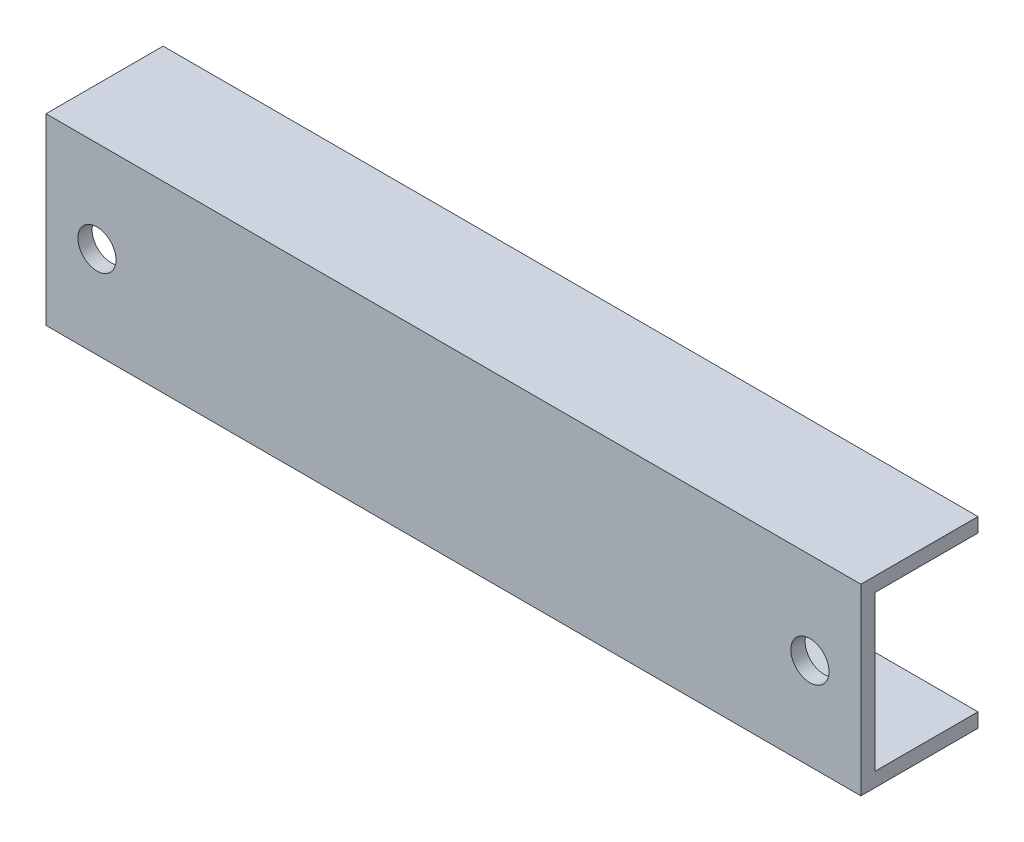
ISO-10303-21;
HEADER;
FILE_DESCRIPTION(('STEP AP214'),'2;1');
FILE_NAME('part.step','',(''),(''),'','','');
FILE_SCHEMA(('AUTOMOTIVE_DESIGN { 1 0 10303 214 1 1 1 1 }'));
ENDSEC;
DATA;
#1=APPLICATION_CONTEXT('core data for automotive mechanical design processes');
#2=APPLICATION_PROTOCOL_DEFINITION('international standard','automotive_design',2000,#1);
#3=PRODUCT_CONTEXT('',#1,'mechanical');
#4=PRODUCT('Part','Part','',(#3));
#5=PRODUCT_RELATED_PRODUCT_CATEGORY('part','',(#4));
#6=PRODUCT_DEFINITION_FORMATION('','',#4);
#7=PRODUCT_DEFINITION_CONTEXT('part definition',#1,'design');
#8=PRODUCT_DEFINITION('design','',#6,#7);
#9=PRODUCT_DEFINITION_SHAPE('','',#8);
#10=(LENGTH_UNIT() NAMED_UNIT(*) SI_UNIT(.MILLI.,.METRE.));
#11=(NAMED_UNIT(*) PLANE_ANGLE_UNIT() SI_UNIT($,.RADIAN.));
#12=(NAMED_UNIT(*) SI_UNIT($,.STERADIAN.) SOLID_ANGLE_UNIT());
#13=UNCERTAINTY_MEASURE_WITH_UNIT(LENGTH_MEASURE(1.E-05),#10,'distance_accuracy_value','');
#14=(GEOMETRIC_REPRESENTATION_CONTEXT(3) GLOBAL_UNCERTAINTY_ASSIGNED_CONTEXT((#13)) GLOBAL_UNIT_ASSIGNED_CONTEXT((#10,
#11,#12)) REPRESENTATION_CONTEXT('',''));
#15=CARTESIAN_POINT('',(0.,0.,0.));
#16=DIRECTION('',(0.,0.,1.));
#17=DIRECTION('',(1.,0.,0.));
#18=AXIS2_PLACEMENT_3D('',#15,#16,#17);
#19=CARTESIAN_POINT('',(50.8,11.43,-14.605));
#20=DIRECTION('',(0.,-1.,0.));
#21=DIRECTION('',(0.,0.,-1.));
#22=AXIS2_PLACEMENT_3D('',#19,#20,#21);
#23=PLANE('',#22);
#24=DIRECTION('',(0.,0.,1.));
#25=VECTOR('',#24,1.);
#26=CARTESIAN_POINT('',(-50.8,11.43,-14.605));
#27=LINE('',#26,#25);
#28=CARTESIAN_POINT('',(-50.8,11.43,-14.605));
#29=VERTEX_POINT('',#28);
#30=CARTESIAN_POINT('',(-50.8,11.43,0.));
#31=VERTEX_POINT('',#30);
#32=EDGE_CURVE('E137',#29,#31,#27,.T.);
#33=ORIENTED_EDGE('',*,*,#32,.T.);
#34=DIRECTION('',(-1.,0.,0.));
#35=VECTOR('',#34,1.);
#36=CARTESIAN_POINT('',(50.8,11.43,0.));
#37=LINE('',#36,#35);
#38=CARTESIAN_POINT('',(50.8,11.43,0.));
#39=VERTEX_POINT('',#38);
#40=EDGE_CURVE('E11',#39,#31,#37,.T.);
#41=ORIENTED_EDGE('',*,*,#40,.F.);
#42=DIRECTION('',(0.,0.,1.));
#43=VECTOR('',#42,1.);
#44=CARTESIAN_POINT('',(50.8,11.43,-14.605));
#45=LINE('',#44,#43);
#46=CARTESIAN_POINT('',(50.8,11.43,-14.605));
#47=VERTEX_POINT('',#46);
#48=EDGE_CURVE('E152',#47,#39,#45,.T.);
#49=ORIENTED_EDGE('',*,*,#48,.F.);
#50=DIRECTION('',(-1.,0.,0.));
#51=VECTOR('',#50,1.);
#52=CARTESIAN_POINT('',(50.8,11.43,-14.605));
#53=LINE('',#52,#51);
#54=EDGE_CURVE('E133',#47,#29,#53,.T.);
#55=ORIENTED_EDGE('',*,*,#54,.T.);
#56=EDGE_LOOP('',(#33,#41,#49,#55));
#57=FACE_BOUND('',#56,.T.);
#58=ADVANCED_FACE('F39',(#57),#23,.F.);
#59=CARTESIAN_POINT('',(50.8,11.43,0.));
#60=DIRECTION('',(0.,0.,-1.));
#61=DIRECTION('',(-1.,0.,0.));
#62=AXIS2_PLACEMENT_3D('',#59,#60,#61);
#63=PLANE('',#62);
#64=CARTESIAN_POINT('',(-44.45,0.,0.));
#65=DIRECTION('',(0.,0.,-1.));
#66=DIRECTION('',(-1.,0.,0.));
#67=AXIS2_PLACEMENT_3D('',#64,#65,#66);
#68=CIRCLE('',#67,2.38125);
#69=CARTESIAN_POINT('',(-46.83125,0.,0.));
#70=VERTEX_POINT('',#69);
#71=EDGE_CURVE('E172',#70,#70,#68,.T.);
#72=ORIENTED_EDGE('',*,*,#71,.T.);
#73=EDGE_LOOP('',(#72));
#74=FACE_BOUND('',#73,.T.);
#75=CARTESIAN_POINT('',(44.45,0.,0.));
#76=DIRECTION('',(0.,0.,1.));
#77=DIRECTION('',(1.,0.,0.));
#78=AXIS2_PLACEMENT_3D('',#75,#76,#77);
#79=CIRCLE('',#78,2.38125);
#80=CARTESIAN_POINT('',(46.83125,0.,0.));
#81=VERTEX_POINT('',#80);
#82=EDGE_CURVE('E164',#81,#81,#79,.T.);
#83=ORIENTED_EDGE('',*,*,#82,.F.);
#84=EDGE_LOOP('',(#83));
#85=FACE_BOUND('',#84,.T.);
#86=DIRECTION('',(0.,-1.,0.));
#87=VECTOR('',#86,1.);
#88=CARTESIAN_POINT('',(-50.8,11.43,0.));
#89=LINE('',#88,#87);
#90=CARTESIAN_POINT('',(-50.8,-11.43,0.));
#91=VERTEX_POINT('',#90);
#92=EDGE_CURVE('E140',#31,#91,#89,.T.);
#93=ORIENTED_EDGE('',*,*,#92,.T.);
#94=DIRECTION('',(-1.,0.,0.));
#95=VECTOR('',#94,1.);
#96=CARTESIAN_POINT('',(50.8,-11.43,0.));
#97=LINE('',#96,#95);
#98=CARTESIAN_POINT('',(50.8,-11.43,0.));
#99=VERTEX_POINT('',#98);
#100=EDGE_CURVE('E48',#99,#91,#97,.T.);
#101=ORIENTED_EDGE('',*,*,#100,.F.);
#102=DIRECTION('',(0.,-1.,0.));
#103=VECTOR('',#102,1.);
#104=CARTESIAN_POINT('',(50.8,11.43,0.));
#105=LINE('',#104,#103);
#106=EDGE_CURVE('E100',#39,#99,#105,.T.);
#107=ORIENTED_EDGE('',*,*,#106,.F.);
#108=ORIENTED_EDGE('',*,*,#40,.T.);
#109=EDGE_LOOP('',(#93,#101,#107,#108));
#110=FACE_BOUND('',#109,.T.);
#111=ADVANCED_FACE('F208',(#74,#85,#110),#63,.F.);
#112=CARTESIAN_POINT('',(50.8,-11.43,0.));
#113=DIRECTION('',(0.,1.,0.));
#114=DIRECTION('',(0.,0.,1.));
#115=AXIS2_PLACEMENT_3D('',#112,#113,#114);
#116=PLANE('',#115);
#117=DIRECTION('',(0.,0.,-1.));
#118=VECTOR('',#117,1.);
#119=CARTESIAN_POINT('',(-50.8,-11.43,0.));
#120=LINE('',#119,#118);
#121=CARTESIAN_POINT('',(-50.8,-11.43,-14.605));
#122=VERTEX_POINT('',#121);
#123=EDGE_CURVE('E143',#91,#122,#120,.T.);
#124=ORIENTED_EDGE('',*,*,#123,.T.);
#125=DIRECTION('',(-1.,0.,0.));
#126=VECTOR('',#125,1.);
#127=CARTESIAN_POINT('',(50.8,-11.43,-14.605));
#128=LINE('',#127,#126);
#129=CARTESIAN_POINT('',(50.8,-11.43,-14.605));
#130=VERTEX_POINT('',#129);
#131=EDGE_CURVE('E159',#130,#122,#128,.T.);
#132=ORIENTED_EDGE('',*,*,#131,.F.);
#133=DIRECTION('',(0.,0.,-1.));
#134=VECTOR('',#133,1.);
#135=CARTESIAN_POINT('',(50.8,-11.43,0.));
#136=LINE('',#135,#134);
#137=EDGE_CURVE('E177',#99,#130,#136,.T.);
#138=ORIENTED_EDGE('',*,*,#137,.F.);
#139=ORIENTED_EDGE('',*,*,#100,.T.);
#140=EDGE_LOOP('',(#124,#132,#138,#139));
#141=FACE_BOUND('',#140,.T.);
#142=ADVANCED_FACE('F212',(#141),#116,.F.);
#143=CARTESIAN_POINT('',(50.8,-11.43,-14.605));
#144=DIRECTION('',(0.,0.,1.));
#145=DIRECTION('',(1.,0.,0.));
#146=AXIS2_PLACEMENT_3D('',#143,#144,#145);
#147=PLANE('',#146);
#148=DIRECTION('',(0.,1.,0.));
#149=VECTOR('',#148,1.);
#150=CARTESIAN_POINT('',(-50.8,-11.43,-14.605));
#151=LINE('',#150,#149);
#152=CARTESIAN_POINT('',(-50.8,-9.652,-14.605));
#153=VERTEX_POINT('',#152);
#154=EDGE_CURVE('E145',#122,#153,#151,.T.);
#155=ORIENTED_EDGE('',*,*,#154,.T.);
#156=DIRECTION('',(-1.,0.,0.));
#157=VECTOR('',#156,1.);
#158=CARTESIAN_POINT('',(50.8,-9.652,-14.605));
#159=LINE('',#158,#157);
#160=CARTESIAN_POINT('',(50.8,-9.652,-14.605));
#161=VERTEX_POINT('',#160);
#162=EDGE_CURVE('E156',#161,#153,#159,.T.);
#163=ORIENTED_EDGE('',*,*,#162,.F.);
#164=DIRECTION('',(0.,1.,0.));
#165=VECTOR('',#164,1.);
#166=CARTESIAN_POINT('',(50.8,-11.43,-14.605));
#167=LINE('',#166,#165);
#168=EDGE_CURVE('E179',#130,#161,#167,.T.);
#169=ORIENTED_EDGE('',*,*,#168,.F.);
#170=ORIENTED_EDGE('',*,*,#131,.T.);
#171=EDGE_LOOP('',(#155,#163,#169,#170));
#172=FACE_BOUND('',#171,.T.);
#173=ADVANCED_FACE('F185',(#172),#147,.F.);
#174=CARTESIAN_POINT('',(50.8,-9.652,-14.605));
#175=DIRECTION('',(0.,-1.,0.));
#176=DIRECTION('',(0.,0.,-1.));
#177=AXIS2_PLACEMENT_3D('',#174,#175,#176);
#178=PLANE('',#177);
#179=DIRECTION('',(0.,0.,1.));
#180=VECTOR('',#179,1.);
#181=CARTESIAN_POINT('',(-50.8,-9.652,-14.605));
#182=LINE('',#181,#180);
#183=CARTESIAN_POINT('',(-50.8,-9.652,-1.778));
#184=VERTEX_POINT('',#183);
#185=EDGE_CURVE('E147',#153,#184,#182,.T.);
#186=ORIENTED_EDGE('',*,*,#185,.T.);
#187=DIRECTION('',(-1.,0.,0.));
#188=VECTOR('',#187,1.);
#189=CARTESIAN_POINT('',(50.8,-9.652,-1.778));
#190=LINE('',#189,#188);
#191=CARTESIAN_POINT('',(50.8,-9.652,-1.778));
#192=VERTEX_POINT('',#191);
#193=EDGE_CURVE('E128',#192,#184,#190,.T.);
#194=ORIENTED_EDGE('',*,*,#193,.F.);
#195=DIRECTION('',(0.,0.,1.));
#196=VECTOR('',#195,1.);
#197=CARTESIAN_POINT('',(50.8,-9.652,-14.605));
#198=LINE('',#197,#196);
#199=EDGE_CURVE('E119',#161,#192,#198,.T.);
#200=ORIENTED_EDGE('',*,*,#199,.F.);
#201=ORIENTED_EDGE('',*,*,#162,.T.);
#202=EDGE_LOOP('',(#186,#194,#200,#201));
#203=FACE_BOUND('',#202,.T.);
#204=ADVANCED_FACE('F189',(#203),#178,.F.);
#205=CARTESIAN_POINT('',(50.8,-9.652,-1.778));
#206=DIRECTION('',(0.,0.,1.));
#207=DIRECTION('',(1.,0.,0.));
#208=AXIS2_PLACEMENT_3D('',#205,#206,#207);
#209=PLANE('',#208);
#210=CARTESIAN_POINT('',(-44.45,0.,-1.778));
#211=DIRECTION('',(0.,0.,1.));
#212=DIRECTION('',(1.,0.,0.));
#213=AXIS2_PLACEMENT_3D('',#210,#211,#212);
#214=CIRCLE('',#213,2.38125);
#215=CARTESIAN_POINT('',(-42.06875,0.,-1.778));
#216=VERTEX_POINT('',#215);
#217=EDGE_CURVE('E42',#216,#216,#214,.F.);
#218=ORIENTED_EDGE('',*,*,#217,.F.);
#219=EDGE_LOOP('',(#218));
#220=FACE_BOUND('',#219,.T.);
#221=CARTESIAN_POINT('',(44.45,0.,-1.778));
#222=DIRECTION('',(0.,0.,1.));
#223=DIRECTION('',(1.,0.,0.));
#224=AXIS2_PLACEMENT_3D('',#221,#222,#223);
#225=CIRCLE('',#224,2.38125);
#226=CARTESIAN_POINT('',(46.83125,0.,-1.778));
#227=VERTEX_POINT('',#226);
#228=EDGE_CURVE('E141',#227,#227,#225,.T.);
#229=ORIENTED_EDGE('',*,*,#228,.T.);
#230=EDGE_LOOP('',(#229));
#231=FACE_BOUND('',#230,.T.);
#232=DIRECTION('',(0.,1.,0.));
#233=VECTOR('',#232,1.);
#234=CARTESIAN_POINT('',(-50.8,-9.652,-1.778));
#235=LINE('',#234,#233);
#236=CARTESIAN_POINT('',(-50.8,9.652,-1.778));
#237=VERTEX_POINT('',#236);
#238=EDGE_CURVE('E127',#184,#237,#235,.T.);
#239=ORIENTED_EDGE('',*,*,#238,.T.);
#240=DIRECTION('',(-1.,0.,0.));
#241=VECTOR('',#240,1.);
#242=CARTESIAN_POINT('',(50.8,9.652,-1.778));
#243=LINE('',#242,#241);
#244=CARTESIAN_POINT('',(50.8,9.652,-1.778));
#245=VERTEX_POINT('',#244);
#246=EDGE_CURVE('E124',#245,#237,#243,.T.);
#247=ORIENTED_EDGE('',*,*,#246,.F.);
#248=DIRECTION('',(0.,1.,0.));
#249=VECTOR('',#248,1.);
#250=CARTESIAN_POINT('',(50.8,-9.652,-1.778));
#251=LINE('',#250,#249);
#252=EDGE_CURVE('E113',#192,#245,#251,.T.);
#253=ORIENTED_EDGE('',*,*,#252,.F.);
#254=ORIENTED_EDGE('',*,*,#193,.T.);
#255=EDGE_LOOP('',(#239,#247,#253,#254));
#256=FACE_BOUND('',#255,.T.);
#257=ADVANCED_FACE('F125',(#220,#231,#256),#209,.F.);
#258=CARTESIAN_POINT('',(50.8,9.652,-1.778));
#259=DIRECTION('',(0.,1.,0.));
#260=DIRECTION('',(0.,0.,1.));
#261=AXIS2_PLACEMENT_3D('',#258,#259,#260);
#262=PLANE('',#261);
#263=DIRECTION('',(0.,0.,-1.));
#264=VECTOR('',#263,1.);
#265=CARTESIAN_POINT('',(-50.8,9.652,-1.778));
#266=LINE('',#265,#264);
#267=CARTESIAN_POINT('',(-50.8,9.652,-14.605));
#268=VERTEX_POINT('',#267);
#269=EDGE_CURVE('E86',#237,#268,#266,.T.);
#270=ORIENTED_EDGE('',*,*,#269,.T.);
#271=DIRECTION('',(-1.,0.,0.));
#272=VECTOR('',#271,1.);
#273=CARTESIAN_POINT('',(50.8,9.652,-14.605));
#274=LINE('',#273,#272);
#275=CARTESIAN_POINT('',(50.8,9.652,-14.605));
#276=VERTEX_POINT('',#275);
#277=EDGE_CURVE('E129',#276,#268,#274,.T.);
#278=ORIENTED_EDGE('',*,*,#277,.F.);
#279=DIRECTION('',(0.,0.,-1.));
#280=VECTOR('',#279,1.);
#281=CARTESIAN_POINT('',(50.8,9.652,-1.778));
#282=LINE('',#281,#280);
#283=EDGE_CURVE('E117',#245,#276,#282,.T.);
#284=ORIENTED_EDGE('',*,*,#283,.F.);
#285=ORIENTED_EDGE('',*,*,#246,.T.);
#286=EDGE_LOOP('',(#270,#278,#284,#285));
#287=FACE_BOUND('',#286,.T.);
#288=ADVANCED_FACE('F131',(#287),#262,.F.);
#289=CARTESIAN_POINT('',(50.8,9.652,-14.605));
#290=DIRECTION('',(0.,0.,1.));
#291=DIRECTION('',(1.,0.,0.));
#292=AXIS2_PLACEMENT_3D('',#289,#290,#291);
#293=PLANE('',#292);
#294=DIRECTION('',(0.,1.,0.));
#295=VECTOR('',#294,1.);
#296=CARTESIAN_POINT('',(-50.8,9.652,-14.605));
#297=LINE('',#296,#295);
#298=EDGE_CURVE('E92',#268,#29,#297,.T.);
#299=ORIENTED_EDGE('',*,*,#298,.T.);
#300=ORIENTED_EDGE('',*,*,#54,.F.);
#301=DIRECTION('',(0.,1.,0.));
#302=VECTOR('',#301,1.);
#303=CARTESIAN_POINT('',(50.8,9.652,-14.605));
#304=LINE('',#303,#302);
#305=EDGE_CURVE('E57',#276,#47,#304,.T.);
#306=ORIENTED_EDGE('',*,*,#305,.F.);
#307=ORIENTED_EDGE('',*,*,#277,.T.);
#308=EDGE_LOOP('',(#299,#300,#306,#307));
#309=FACE_BOUND('',#308,.T.);
#310=ADVANCED_FACE('F197',(#309),#293,.F.);
#311=CARTESIAN_POINT('',(50.8,0.,0.));
#312=DIRECTION('',(1.,0.,0.));
#313=DIRECTION('',(0.,0.,-1.));
#314=AXIS2_PLACEMENT_3D('',#311,#312,#313);
#315=PLANE('',#314);
#316=ORIENTED_EDGE('',*,*,#48,.T.);
#317=ORIENTED_EDGE('',*,*,#106,.T.);
#318=ORIENTED_EDGE('',*,*,#137,.T.);
#319=ORIENTED_EDGE('',*,*,#168,.T.);
#320=ORIENTED_EDGE('',*,*,#199,.T.);
#321=ORIENTED_EDGE('',*,*,#252,.T.);
#322=ORIENTED_EDGE('',*,*,#283,.T.);
#323=ORIENTED_EDGE('',*,*,#305,.T.);
#324=EDGE_LOOP('',(#316,#317,#318,#319,#320,#321,#322,#323));
#325=FACE_BOUND('',#324,.T.);
#326=ADVANCED_FACE('F115',(#325),#315,.T.);
#327=CARTESIAN_POINT('',(-50.8,0.,0.));
#328=DIRECTION('',(1.,0.,0.));
#329=DIRECTION('',(0.,0.,-1.));
#330=AXIS2_PLACEMENT_3D('',#327,#328,#329);
#331=PLANE('',#330);
#332=ORIENTED_EDGE('',*,*,#32,.F.);
#333=ORIENTED_EDGE('',*,*,#298,.F.);
#334=ORIENTED_EDGE('',*,*,#269,.F.);
#335=ORIENTED_EDGE('',*,*,#238,.F.);
#336=ORIENTED_EDGE('',*,*,#185,.F.);
#337=ORIENTED_EDGE('',*,*,#154,.F.);
#338=ORIENTED_EDGE('',*,*,#123,.F.);
#339=ORIENTED_EDGE('',*,*,#92,.F.);
#340=EDGE_LOOP('',(#332,#333,#334,#335,#336,#337,#338,#339));
#341=FACE_BOUND('',#340,.T.);
#342=ADVANCED_FACE('F192',(#341),#331,.F.);
#343=CARTESIAN_POINT('',(44.45,0.,-14.605));
#344=DIRECTION('',(0.,0.,1.));
#345=DIRECTION('',(1.,0.,0.));
#346=AXIS2_PLACEMENT_3D('',#343,#344,#345);
#347=CYLINDRICAL_SURFACE('',#346,2.38125);
#348=ORIENTED_EDGE('',*,*,#82,.T.);
#349=EDGE_LOOP('',(#348));
#350=FACE_BOUND('',#349,.T.);
#351=ORIENTED_EDGE('',*,*,#228,.F.);
#352=EDGE_LOOP('',(#351));
#353=FACE_BOUND('',#352,.T.);
#354=ADVANCED_FACE('F234',(#350,#353),#347,.F.);
#355=CARTESIAN_POINT('',(-44.45,0.,-14.605));
#356=DIRECTION('',(0.,0.,1.));
#357=DIRECTION('',(1.,0.,0.));
#358=AXIS2_PLACEMENT_3D('',#355,#356,#357);
#359=CYLINDRICAL_SURFACE('',#358,2.38125);
#360=ORIENTED_EDGE('',*,*,#71,.F.);
#361=EDGE_LOOP('',(#360));
#362=FACE_BOUND('',#361,.T.);
#363=ORIENTED_EDGE('',*,*,#217,.T.);
#364=EDGE_LOOP('',(#363));
#365=FACE_BOUND('',#364,.T.);
#366=ADVANCED_FACE('F232',(#362,#365),#359,.F.);
#367=CLOSED_SHELL('',(#58,#111,#142,#173,#204,#257,#288,#310,#326,#342,#354,#366));
#368=MANIFOLD_SOLID_BREP('B2',#367);
#369=ADVANCED_BREP_SHAPE_REPRESENTATION('',(#18,#368),#14);
#370=SHAPE_DEFINITION_REPRESENTATION(#9,#369);
ENDSEC;
END-ISO-10303-21;
